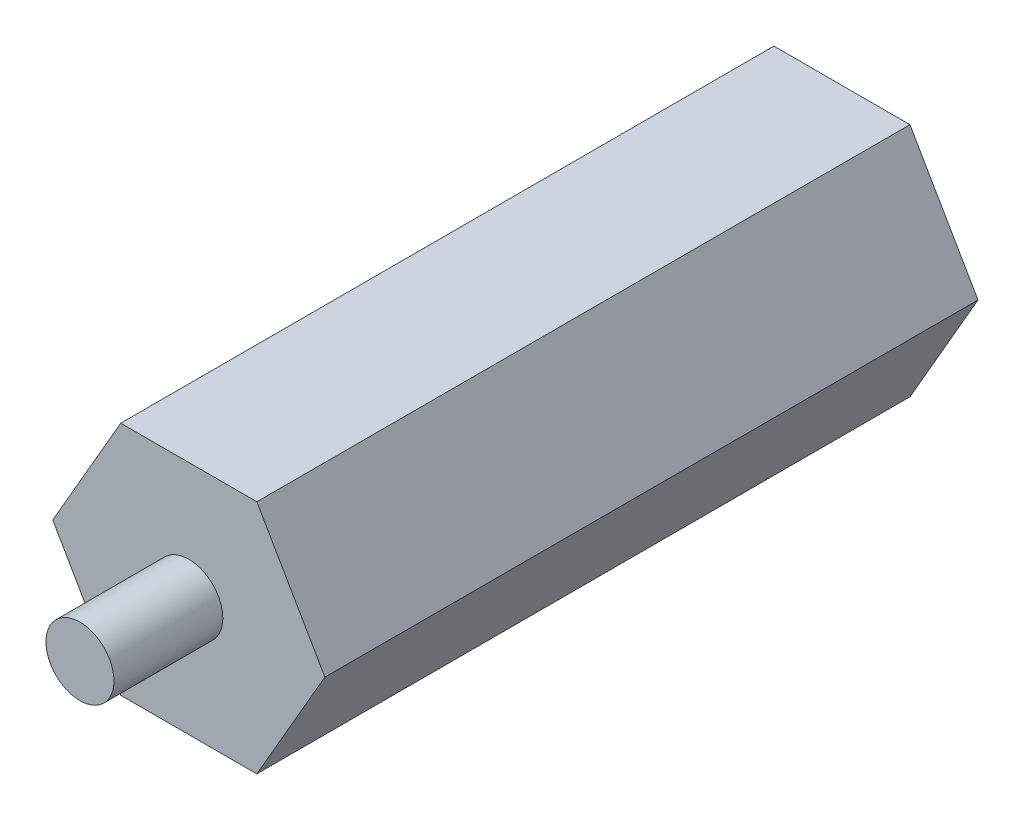
ISO-10303-21;
HEADER;
FILE_DESCRIPTION(('STEP AP214'),'2;1');
FILE_NAME('part.step','',(''),(''),'','','');
FILE_SCHEMA(('AUTOMOTIVE_DESIGN { 1 0 10303 214 1 1 1 1 }'));
ENDSEC;
DATA;
#1=APPLICATION_CONTEXT('core data for automotive mechanical design processes');
#2=APPLICATION_PROTOCOL_DEFINITION('international standard','automotive_design',2000,#1);
#3=PRODUCT_CONTEXT('',#1,'mechanical');
#4=PRODUCT('Part','Part','',(#3));
#5=PRODUCT_RELATED_PRODUCT_CATEGORY('part','',(#4));
#6=PRODUCT_DEFINITION_FORMATION('','',#4);
#7=PRODUCT_DEFINITION_CONTEXT('part definition',#1,'design');
#8=PRODUCT_DEFINITION('design','',#6,#7);
#9=PRODUCT_DEFINITION_SHAPE('','',#8);
#10=(LENGTH_UNIT() NAMED_UNIT(*) SI_UNIT(.MILLI.,.METRE.));
#11=(NAMED_UNIT(*) PLANE_ANGLE_UNIT() SI_UNIT($,.RADIAN.));
#12=(NAMED_UNIT(*) SI_UNIT($,.STERADIAN.) SOLID_ANGLE_UNIT());
#13=UNCERTAINTY_MEASURE_WITH_UNIT(LENGTH_MEASURE(1.E-05),#10,'distance_accuracy_value','');
#14=(GEOMETRIC_REPRESENTATION_CONTEXT(3) GLOBAL_UNCERTAINTY_ASSIGNED_CONTEXT((#13)) GLOBAL_UNIT_ASSIGNED_CONTEXT((#10,
#11,#12)) REPRESENTATION_CONTEXT('',''));
#15=CARTESIAN_POINT('',(0.,0.,0.));
#16=DIRECTION('',(0.,0.,1.));
#17=DIRECTION('',(1.,0.,0.));
#18=AXIS2_PLACEMENT_3D('',#15,#16,#17);
#19=CARTESIAN_POINT('',(-31.7500000000006,54.9926131403114,-304.8));
#20=DIRECTION('',(-0.866025403784442,0.499999999999995,0.));
#21=DIRECTION('',(-0.499999999999995,-0.866025403784442,0.));
#22=AXIS2_PLACEMENT_3D('',#19,#20,#21);
#23=PLANE('',#22);
#24=DIRECTION('',(-0.499999999999995,-0.866025403784441,0.));
#25=VECTOR('',#24,1.);
#26=CARTESIAN_POINT('',(-31.7500000000006,54.9926131403114,0.));
#27=LINE('',#26,#25);
#28=CARTESIAN_POINT('',(-31.7500000000006,54.9926131403114,0.));
#29=VERTEX_POINT('',#28);
#30=CARTESIAN_POINT('',(-63.4999999999999,0.,0.));
#31=VERTEX_POINT('',#30);
#32=EDGE_CURVE('E123',#29,#31,#27,.T.);
#33=ORIENTED_EDGE('',*,*,#32,.F.);
#34=DIRECTION('',(0.,0.,1.));
#35=VECTOR('',#34,1.);
#36=CARTESIAN_POINT('',(-31.7500000000006,54.9926131403114,-304.8));
#37=LINE('',#36,#35);
#38=CARTESIAN_POINT('',(-31.7500000000006,54.9926131403114,-304.8));
#39=VERTEX_POINT('',#38);
#40=EDGE_CURVE('E45',#39,#29,#37,.T.);
#41=ORIENTED_EDGE('',*,*,#40,.F.);
#42=DIRECTION('',(-0.499999999999995,-0.866025403784441,0.));
#43=VECTOR('',#42,1.);
#44=CARTESIAN_POINT('',(-31.7500000000006,54.9926131403114,-304.8));
#45=LINE('',#44,#43);
#46=CARTESIAN_POINT('',(-63.4999999999999,0.,-304.8));
#47=VERTEX_POINT('',#46);
#48=EDGE_CURVE('E139',#39,#47,#45,.T.);
#49=ORIENTED_EDGE('',*,*,#48,.T.);
#50=DIRECTION('',(0.,0.,1.));
#51=VECTOR('',#50,1.);
#52=CARTESIAN_POINT('',(-63.4999999999999,0.,-304.8));
#53=LINE('',#52,#51);
#54=EDGE_CURVE('E87',#47,#31,#53,.T.);
#55=ORIENTED_EDGE('',*,*,#54,.T.);
#56=EDGE_LOOP('',(#33,#41,#49,#55));
#57=FACE_BOUND('',#56,.T.);
#58=ADVANCED_FACE('F37',(#57),#23,.T.);
#59=CARTESIAN_POINT('',(31.7499999999994,54.992613140312,-304.8));
#60=DIRECTION('',(0.,1.,0.));
#61=DIRECTION('',(-1.,0.,0.));
#62=AXIS2_PLACEMENT_3D('',#59,#60,#61);
#63=PLANE('',#62);
#64=DIRECTION('',(-1.,0.,0.));
#65=VECTOR('',#64,1.);
#66=CARTESIAN_POINT('',(31.7499999999994,54.992613140312,0.));
#67=LINE('',#66,#65);
#68=CARTESIAN_POINT('',(31.7499999999994,54.992613140312,0.));
#69=VERTEX_POINT('',#68);
#70=EDGE_CURVE('E136',#69,#29,#67,.T.);
#71=ORIENTED_EDGE('',*,*,#70,.F.);
#72=DIRECTION('',(0.,0.,1.));
#73=VECTOR('',#72,1.);
#74=CARTESIAN_POINT('',(31.7499999999994,54.992613140312,-304.8));
#75=LINE('',#74,#73);
#76=CARTESIAN_POINT('',(31.7499999999994,54.992613140312,-304.8));
#77=VERTEX_POINT('',#76);
#78=EDGE_CURVE('E75',#77,#69,#75,.T.);
#79=ORIENTED_EDGE('',*,*,#78,.F.);
#80=DIRECTION('',(-1.,0.,0.));
#81=VECTOR('',#80,1.);
#82=CARTESIAN_POINT('',(31.7499999999994,54.992613140312,-304.8));
#83=LINE('',#82,#81);
#84=EDGE_CURVE('E113',#77,#39,#83,.T.);
#85=ORIENTED_EDGE('',*,*,#84,.T.);
#86=ORIENTED_EDGE('',*,*,#40,.T.);
#87=EDGE_LOOP('',(#71,#79,#85,#86));
#88=FACE_BOUND('',#87,.T.);
#89=ADVANCED_FACE('F148',(#88),#63,.T.);
#90=CARTESIAN_POINT('',(63.4999999999999,4.43418130033077E-13,-304.8));
#91=DIRECTION('',(0.866025403784434,0.500000000000007,0.));
#92=DIRECTION('',(-0.500000000000007,0.866025403784435,0.));
#93=AXIS2_PLACEMENT_3D('',#90,#91,#92);
#94=PLANE('',#93);
#95=DIRECTION('',(-0.500000000000007,0.866025403784434,0.));
#96=VECTOR('',#95,1.);
#97=CARTESIAN_POINT('',(63.4999999999999,4.43418130033077E-13,0.));
#98=LINE('',#97,#96);
#99=CARTESIAN_POINT('',(63.4999999999999,4.43418130033077E-13,0.));
#100=VERTEX_POINT('',#99);
#101=EDGE_CURVE('E100',#100,#69,#98,.T.);
#102=ORIENTED_EDGE('',*,*,#101,.F.);
#103=DIRECTION('',(0.,0.,1.));
#104=VECTOR('',#103,1.);
#105=CARTESIAN_POINT('',(63.4999999999999,4.43418130033077E-13,-304.8));
#106=LINE('',#105,#104);
#107=CARTESIAN_POINT('',(63.4999999999999,4.43418130033077E-13,-304.8));
#108=VERTEX_POINT('',#107);
#109=EDGE_CURVE('E95',#108,#100,#106,.T.);
#110=ORIENTED_EDGE('',*,*,#109,.F.);
#111=DIRECTION('',(-0.500000000000007,0.866025403784434,0.));
#112=VECTOR('',#111,1.);
#113=CARTESIAN_POINT('',(63.4999999999999,4.43418130033077E-13,-304.8));
#114=LINE('',#113,#112);
#115=EDGE_CURVE('E98',#108,#77,#114,.T.);
#116=ORIENTED_EDGE('',*,*,#115,.T.);
#117=ORIENTED_EDGE('',*,*,#78,.T.);
#118=EDGE_LOOP('',(#102,#110,#116,#117));
#119=FACE_BOUND('',#118,.T.);
#120=ADVANCED_FACE('F97',(#119),#94,.T.);
#121=CARTESIAN_POINT('',(31.7500000000002,-54.9926131403116,-304.8));
#122=DIRECTION('',(0.866025403784442,-0.499999999999995,0.));
#123=DIRECTION('',(0.499999999999995,0.866025403784442,0.));
#124=AXIS2_PLACEMENT_3D('',#121,#122,#123);
#125=PLANE('',#124);
#126=DIRECTION('',(0.499999999999995,0.866025403784442,0.));
#127=VECTOR('',#126,1.);
#128=CARTESIAN_POINT('',(31.7500000000002,-54.9926131403116,0.));
#129=LINE('',#128,#127);
#130=CARTESIAN_POINT('',(31.7500000000002,-54.9926131403116,0.));
#131=VERTEX_POINT('',#130);
#132=EDGE_CURVE('E133',#131,#100,#129,.T.);
#133=ORIENTED_EDGE('',*,*,#132,.F.);
#134=DIRECTION('',(0.,0.,1.));
#135=VECTOR('',#134,1.);
#136=CARTESIAN_POINT('',(31.7500000000002,-54.9926131403116,-304.8));
#137=LINE('',#136,#135);
#138=CARTESIAN_POINT('',(31.7500000000002,-54.9926131403116,-304.8));
#139=VERTEX_POINT('',#138);
#140=EDGE_CURVE('E105',#139,#131,#137,.T.);
#141=ORIENTED_EDGE('',*,*,#140,.F.);
#142=DIRECTION('',(0.499999999999995,0.866025403784442,0.));
#143=VECTOR('',#142,1.);
#144=CARTESIAN_POINT('',(31.7500000000002,-54.9926131403116,-304.8));
#145=LINE('',#144,#143);
#146=EDGE_CURVE('E111',#139,#108,#145,.T.);
#147=ORIENTED_EDGE('',*,*,#146,.T.);
#148=ORIENTED_EDGE('',*,*,#109,.T.);
#149=EDGE_LOOP('',(#133,#141,#147,#148));
#150=FACE_BOUND('',#149,.T.);
#151=ADVANCED_FACE('F115',(#150),#125,.T.);
#152=CARTESIAN_POINT('',(-31.7499999999998,-54.9926131403118,-304.8));
#153=DIRECTION('',(0.,-1.,0.));
#154=DIRECTION('',(1.,0.,0.));
#155=AXIS2_PLACEMENT_3D('',#152,#153,#154);
#156=PLANE('',#155);
#157=DIRECTION('',(1.,0.,0.));
#158=VECTOR('',#157,1.);
#159=CARTESIAN_POINT('',(-31.7499999999998,-54.9926131403118,0.));
#160=LINE('',#159,#158);
#161=CARTESIAN_POINT('',(-31.7499999999998,-54.9926131403118,0.));
#162=VERTEX_POINT('',#161);
#163=EDGE_CURVE('E130',#162,#131,#160,.T.);
#164=ORIENTED_EDGE('',*,*,#163,.F.);
#165=DIRECTION('',(0.,0.,1.));
#166=VECTOR('',#165,1.);
#167=CARTESIAN_POINT('',(-31.7499999999998,-54.9926131403118,-304.8));
#168=LINE('',#167,#166);
#169=CARTESIAN_POINT('',(-31.7499999999998,-54.9926131403118,-304.8));
#170=VERTEX_POINT('',#169);
#171=EDGE_CURVE('E143',#170,#162,#168,.T.);
#172=ORIENTED_EDGE('',*,*,#171,.F.);
#173=DIRECTION('',(1.,0.,0.));
#174=VECTOR('',#173,1.);
#175=CARTESIAN_POINT('',(-31.7499999999998,-54.9926131403118,-304.8));
#176=LINE('',#175,#174);
#177=EDGE_CURVE('E116',#170,#139,#176,.T.);
#178=ORIENTED_EDGE('',*,*,#177,.T.);
#179=ORIENTED_EDGE('',*,*,#140,.T.);
#180=EDGE_LOOP('',(#164,#172,#178,#179));
#181=FACE_BOUND('',#180,.T.);
#182=ADVANCED_FACE('F161',(#181),#156,.T.);
#183=CARTESIAN_POINT('',(-63.4999999999999,0.,-304.8));
#184=DIRECTION('',(-0.866025403784438,-0.500000000000001,0.));
#185=DIRECTION('',(0.500000000000001,-0.866025403784438,0.));
#186=AXIS2_PLACEMENT_3D('',#183,#184,#185);
#187=PLANE('',#186);
#188=DIRECTION('',(0.500000000000001,-0.866025403784438,0.));
#189=VECTOR('',#188,1.);
#190=CARTESIAN_POINT('',(-63.4999999999999,0.,0.));
#191=LINE('',#190,#189);
#192=EDGE_CURVE('E126',#31,#162,#191,.T.);
#193=ORIENTED_EDGE('',*,*,#192,.F.);
#194=ORIENTED_EDGE('',*,*,#54,.F.);
#195=DIRECTION('',(0.500000000000001,-0.866025403784438,0.));
#196=VECTOR('',#195,1.);
#197=CARTESIAN_POINT('',(-63.4999999999999,0.,-304.8));
#198=LINE('',#197,#196);
#199=EDGE_CURVE('E118',#47,#170,#198,.T.);
#200=ORIENTED_EDGE('',*,*,#199,.T.);
#201=ORIENTED_EDGE('',*,*,#171,.T.);
#202=EDGE_LOOP('',(#193,#194,#200,#201));
#203=FACE_BOUND('',#202,.T.);
#204=ADVANCED_FACE('F144',(#203),#187,.T.);
#205=CARTESIAN_POINT('',(0.,0.,-304.8));
#206=DIRECTION('',(0.,0.,1.));
#207=DIRECTION('',(1.,0.,0.));
#208=AXIS2_PLACEMENT_3D('',#205,#206,#207);
#209=PLANE('',#208);
#210=CARTESIAN_POINT('',(0.,0.,-304.8));
#211=DIRECTION('',(0.,0.,1.));
#212=DIRECTION('',(1.,0.,0.));
#213=AXIS2_PLACEMENT_3D('',#210,#211,#212);
#214=CIRCLE('',#213,15.875);
#215=CARTESIAN_POINT('',(15.875,0.,-304.8));
#216=VERTEX_POINT('',#215);
#217=EDGE_CURVE('E11',#216,#216,#214,.F.);
#218=ORIENTED_EDGE('',*,*,#217,.F.);
#219=EDGE_LOOP('',(#218));
#220=FACE_BOUND('',#219,.T.);
#221=ORIENTED_EDGE('',*,*,#48,.F.);
#222=ORIENTED_EDGE('',*,*,#84,.F.);
#223=ORIENTED_EDGE('',*,*,#115,.F.);
#224=ORIENTED_EDGE('',*,*,#146,.F.);
#225=ORIENTED_EDGE('',*,*,#177,.F.);
#226=ORIENTED_EDGE('',*,*,#199,.F.);
#227=EDGE_LOOP('',(#221,#222,#223,#224,#225,#226));
#228=FACE_BOUND('',#227,.T.);
#229=ADVANCED_FACE('F109',(#220,#228),#209,.F.);
#230=CARTESIAN_POINT('',(0.,0.,0.));
#231=DIRECTION('',(0.,0.,1.));
#232=DIRECTION('',(1.,0.,0.));
#233=AXIS2_PLACEMENT_3D('',#230,#231,#232);
#234=PLANE('',#233);
#235=CARTESIAN_POINT('',(0.,0.,0.));
#236=DIRECTION('',(0.,0.,1.));
#237=DIRECTION('',(1.,0.,0.));
#238=AXIS2_PLACEMENT_3D('',#235,#236,#237);
#239=CIRCLE('',#238,15.875);
#240=CARTESIAN_POINT('',(15.875,0.,0.));
#241=VERTEX_POINT('',#240);
#242=EDGE_CURVE('E195',#241,#241,#239,.T.);
#243=ORIENTED_EDGE('',*,*,#242,.F.);
#244=EDGE_LOOP('',(#243));
#245=FACE_BOUND('',#244,.T.);
#246=ORIENTED_EDGE('',*,*,#32,.T.);
#247=ORIENTED_EDGE('',*,*,#192,.T.);
#248=ORIENTED_EDGE('',*,*,#163,.T.);
#249=ORIENTED_EDGE('',*,*,#132,.T.);
#250=ORIENTED_EDGE('',*,*,#101,.T.);
#251=ORIENTED_EDGE('',*,*,#70,.T.);
#252=EDGE_LOOP('',(#246,#247,#248,#249,#250,#251));
#253=FACE_BOUND('',#252,.T.);
#254=ADVANCED_FACE('F147',(#245,#253),#234,.T.);
#255=CARTESIAN_POINT('',(0.,0.,50.8));
#256=DIRECTION('',(0.,0.,-1.));
#257=DIRECTION('',(-1.,0.,0.));
#258=AXIS2_PLACEMENT_3D('',#255,#256,#257);
#259=CYLINDRICAL_SURFACE('',#258,15.875);
#260=CARTESIAN_POINT('',(0.,0.,50.8));
#261=DIRECTION('',(0.,0.,1.));
#262=DIRECTION('',(1.,0.,0.));
#263=AXIS2_PLACEMENT_3D('',#260,#261,#262);
#264=CIRCLE('',#263,15.875);
#265=CARTESIAN_POINT('',(15.875,0.,50.8));
#266=VERTEX_POINT('',#265);
#267=EDGE_CURVE('E127',#266,#266,#264,.T.);
#268=ORIENTED_EDGE('',*,*,#267,.F.);
#269=EDGE_LOOP('',(#268));
#270=FACE_BOUND('',#269,.T.);
#271=ORIENTED_EDGE('',*,*,#242,.T.);
#272=EDGE_LOOP('',(#271));
#273=FACE_BOUND('',#272,.T.);
#274=ADVANCED_FACE('F172',(#270,#273),#259,.T.);
#275=CARTESIAN_POINT('',(0.,0.,50.8));
#276=DIRECTION('',(0.,0.,1.));
#277=DIRECTION('',(1.,0.,0.));
#278=AXIS2_PLACEMENT_3D('',#275,#276,#277);
#279=PLANE('',#278);
#280=ORIENTED_EDGE('',*,*,#267,.T.);
#281=EDGE_LOOP('',(#280));
#282=FACE_BOUND('',#281,.T.);
#283=ADVANCED_FACE('F178',(#282),#279,.T.);
#284=CARTESIAN_POINT('',(0.,0.,-330.2));
#285=DIRECTION('',(0.,0.,1.));
#286=DIRECTION('',(1.,0.,0.));
#287=AXIS2_PLACEMENT_3D('',#284,#285,#286);
#288=CYLINDRICAL_SURFACE('',#287,15.875);
#289=CARTESIAN_POINT('',(0.,0.,-330.2));
#290=DIRECTION('',(0.,0.,-1.));
#291=DIRECTION('',(-1.,0.,0.));
#292=AXIS2_PLACEMENT_3D('',#289,#290,#291);
#293=CIRCLE('',#292,15.875);
#294=CARTESIAN_POINT('',(-15.875,0.,-330.2));
#295=VERTEX_POINT('',#294);
#296=EDGE_CURVE('E194',#295,#295,#293,.T.);
#297=ORIENTED_EDGE('',*,*,#296,.F.);
#298=EDGE_LOOP('',(#297));
#299=FACE_BOUND('',#298,.T.);
#300=ORIENTED_EDGE('',*,*,#217,.T.);
#301=EDGE_LOOP('',(#300));
#302=FACE_BOUND('',#301,.T.);
#303=ADVANCED_FACE('F182',(#299,#302),#288,.T.);
#304=CARTESIAN_POINT('',(0.,0.,-330.2));
#305=DIRECTION('',(0.,0.,-1.));
#306=DIRECTION('',(-1.,0.,0.));
#307=AXIS2_PLACEMENT_3D('',#304,#305,#306);
#308=PLANE('',#307);
#309=ORIENTED_EDGE('',*,*,#296,.T.);
#310=EDGE_LOOP('',(#309));
#311=FACE_BOUND('',#310,.T.);
#312=ADVANCED_FACE('F186',(#311),#308,.T.);
#313=CLOSED_SHELL('',(#58,#89,#120,#151,#182,#204,#229,#254,#274,#283,#303,#312));
#314=MANIFOLD_SOLID_BREP('B2',#313);
#315=ADVANCED_BREP_SHAPE_REPRESENTATION('',(#18,#314),#14);
#316=SHAPE_DEFINITION_REPRESENTATION(#9,#315);
ENDSEC;
END-ISO-10303-21;
